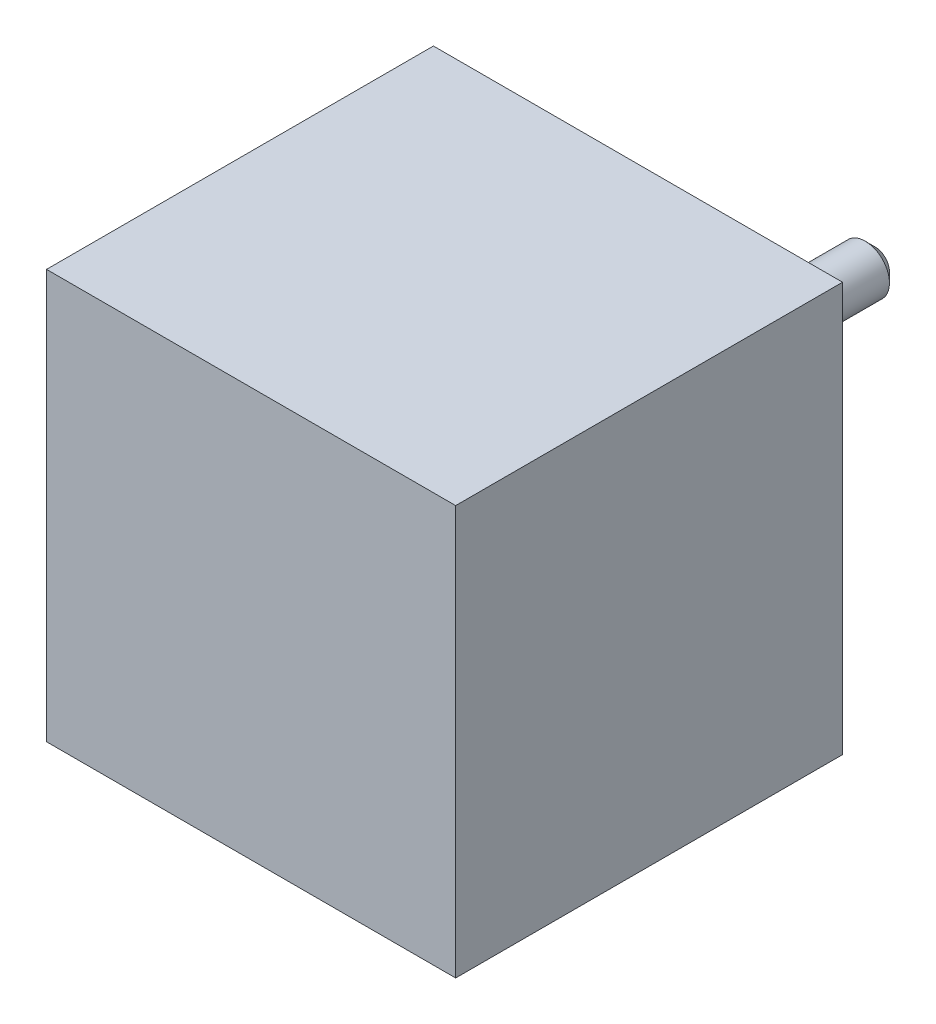
ISO-10303-21;
HEADER;
FILE_DESCRIPTION(('STEP AP214'),'2;1');
FILE_NAME('part.step','',(''),(''),'','','');
FILE_SCHEMA(('AUTOMOTIVE_DESIGN { 1 0 10303 214 1 1 1 1 }'));
ENDSEC;
DATA;
#1=APPLICATION_CONTEXT('core data for automotive mechanical design processes');
#2=APPLICATION_PROTOCOL_DEFINITION('international standard','automotive_design',2000,#1);
#3=PRODUCT_CONTEXT('',#1,'mechanical');
#4=PRODUCT('Part','Part','',(#3));
#5=PRODUCT_RELATED_PRODUCT_CATEGORY('part','',(#4));
#6=PRODUCT_DEFINITION_FORMATION('','',#4);
#7=PRODUCT_DEFINITION_CONTEXT('part definition',#1,'design');
#8=PRODUCT_DEFINITION('design','',#6,#7);
#9=PRODUCT_DEFINITION_SHAPE('','',#8);
#10=(LENGTH_UNIT() NAMED_UNIT(*) SI_UNIT(.MILLI.,.METRE.));
#11=(NAMED_UNIT(*) PLANE_ANGLE_UNIT() SI_UNIT($,.RADIAN.));
#12=(NAMED_UNIT(*) SI_UNIT($,.STERADIAN.) SOLID_ANGLE_UNIT());
#13=UNCERTAINTY_MEASURE_WITH_UNIT(LENGTH_MEASURE(1.E-05),#10,'distance_accuracy_value','');
#14=(GEOMETRIC_REPRESENTATION_CONTEXT(3) GLOBAL_UNCERTAINTY_ASSIGNED_CONTEXT((#13)) GLOBAL_UNIT_ASSIGNED_CONTEXT((#10,
#11,#12)) REPRESENTATION_CONTEXT('',''));
#15=CARTESIAN_POINT('',(0.,0.,0.));
#16=DIRECTION('',(0.,0.,1.));
#17=DIRECTION('',(1.,0.,0.));
#18=AXIS2_PLACEMENT_3D('',#15,#16,#17);
#19=CARTESIAN_POINT('',(21.15,21.15,-2.));
#20=DIRECTION('',(0.,0.,-1.));
#21=DIRECTION('',(-1.,0.,0.));
#22=AXIS2_PLACEMENT_3D('',#19,#20,#21);
#23=PLANE('',#22);
#24=CARTESIAN_POINT('',(21.15,21.15,-2.));
#25=DIRECTION('',(0.,0.,-1.));
#26=DIRECTION('',(-1.,0.,0.));
#27=AXIS2_PLACEMENT_3D('',#24,#25,#26);
#28=CIRCLE('',#27,11.);
#29=CARTESIAN_POINT('',(10.15,21.15,-2.));
#30=VERTEX_POINT('',#29);
#31=EDGE_CURVE('E106',#30,#30,#28,.T.);
#32=ORIENTED_EDGE('',*,*,#31,.T.);
#33=EDGE_LOOP('',(#32));
#34=FACE_BOUND('',#33,.T.);
#35=CARTESIAN_POINT('',(21.15,21.15,-2.));
#36=DIRECTION('',(0.,0.,-1.));
#37=DIRECTION('',(-1.,0.,0.));
#38=AXIS2_PLACEMENT_3D('',#35,#36,#37);
#39=CIRCLE('',#38,2.5);
#40=CARTESIAN_POINT('',(18.65,21.15,-2.));
#41=VERTEX_POINT('',#40);
#42=EDGE_CURVE('E167',#41,#41,#39,.T.);
#43=ORIENTED_EDGE('',*,*,#42,.F.);
#44=EDGE_LOOP('',(#43));
#45=FACE_BOUND('',#44,.T.);
#46=ADVANCED_FACE('F35',(#34,#45),#23,.T.);
#47=CARTESIAN_POINT('',(0.,0.,0.));
#48=DIRECTION('',(0.,0.,-1.));
#49=DIRECTION('',(-1.,0.,0.));
#50=AXIS2_PLACEMENT_3D('',#47,#48,#49);
#51=PLANE('',#50);
#52=CARTESIAN_POINT('',(36.65,36.65,0.));
#53=DIRECTION('',(0.,0.,-1.));
#54=DIRECTION('',(-1.,0.,0.));
#55=AXIS2_PLACEMENT_3D('',#52,#53,#54);
#56=CIRCLE('',#55,1.25);
#57=CARTESIAN_POINT('',(35.4,36.65,0.));
#58=VERTEX_POINT('',#57);
#59=EDGE_CURVE('E192',#58,#58,#56,.T.);
#60=ORIENTED_EDGE('',*,*,#59,.F.);
#61=EDGE_LOOP('',(#60));
#62=FACE_BOUND('',#61,.T.);
#63=CARTESIAN_POINT('',(36.65,5.65,0.));
#64=DIRECTION('',(0.,0.,-1.));
#65=DIRECTION('',(-1.,0.,0.));
#66=AXIS2_PLACEMENT_3D('',#63,#64,#65);
#67=CIRCLE('',#66,1.25);
#68=CARTESIAN_POINT('',(35.4,5.65,0.));
#69=VERTEX_POINT('',#68);
#70=EDGE_CURVE('E186',#69,#69,#67,.T.);
#71=ORIENTED_EDGE('',*,*,#70,.F.);
#72=EDGE_LOOP('',(#71));
#73=FACE_BOUND('',#72,.T.);
#74=CARTESIAN_POINT('',(5.65,5.65,0.));
#75=DIRECTION('',(0.,0.,-1.));
#76=DIRECTION('',(-1.,0.,0.));
#77=AXIS2_PLACEMENT_3D('',#74,#75,#76);
#78=CIRCLE('',#77,1.25);
#79=CARTESIAN_POINT('',(4.4,5.65,0.));
#80=VERTEX_POINT('',#79);
#81=EDGE_CURVE('E180',#80,#80,#78,.T.);
#82=ORIENTED_EDGE('',*,*,#81,.F.);
#83=EDGE_LOOP('',(#82));
#84=FACE_BOUND('',#83,.T.);
#85=CARTESIAN_POINT('',(5.65,36.65,0.));
#86=DIRECTION('',(0.,0.,-1.));
#87=DIRECTION('',(-1.,0.,0.));
#88=AXIS2_PLACEMENT_3D('',#85,#86,#87);
#89=CIRCLE('',#88,1.25);
#90=CARTESIAN_POINT('',(4.4,36.65,0.));
#91=VERTEX_POINT('',#90);
#92=EDGE_CURVE('E174',#91,#91,#89,.T.);
#93=ORIENTED_EDGE('',*,*,#92,.F.);
#94=EDGE_LOOP('',(#93));
#95=FACE_BOUND('',#94,.T.);
#96=DIRECTION('',(0.,-1.,0.));
#97=VECTOR('',#96,1.);
#98=CARTESIAN_POINT('',(0.,0.,0.));
#99=LINE('',#98,#97);
#100=CARTESIAN_POINT('',(0.,42.3,0.));
#101=VERTEX_POINT('',#100);
#102=CARTESIAN_POINT('',(0.,0.,0.));
#103=VERTEX_POINT('',#102);
#104=EDGE_CURVE('E103',#101,#103,#99,.T.);
#105=ORIENTED_EDGE('',*,*,#104,.F.);
#106=DIRECTION('',(-1.,0.,0.));
#107=VECTOR('',#106,1.);
#108=CARTESIAN_POINT('',(0.,42.3,0.));
#109=LINE('',#108,#107);
#110=CARTESIAN_POINT('',(42.3,42.3,0.));
#111=VERTEX_POINT('',#110);
#112=EDGE_CURVE('E75',#111,#101,#109,.T.);
#113=ORIENTED_EDGE('',*,*,#112,.F.);
#114=DIRECTION('',(0.,1.,0.));
#115=VECTOR('',#114,1.);
#116=CARTESIAN_POINT('',(42.3,0.,0.));
#117=LINE('',#116,#115);
#118=CARTESIAN_POINT('',(42.3,0.,0.));
#119=VERTEX_POINT('',#118);
#120=EDGE_CURVE('E69',#119,#111,#117,.T.);
#121=ORIENTED_EDGE('',*,*,#120,.F.);
#122=DIRECTION('',(1.,0.,0.));
#123=VECTOR('',#122,1.);
#124=CARTESIAN_POINT('',(0.,0.,0.));
#125=LINE('',#124,#123);
#126=EDGE_CURVE('E93',#103,#119,#125,.T.);
#127=ORIENTED_EDGE('',*,*,#126,.F.);
#128=EDGE_LOOP('',(#105,#113,#121,#127));
#129=FACE_BOUND('',#128,.T.);
#130=CARTESIAN_POINT('',(21.15,21.15,0.));
#131=DIRECTION('',(0.,0.,-1.));
#132=DIRECTION('',(-1.,0.,0.));
#133=AXIS2_PLACEMENT_3D('',#130,#131,#132);
#134=CIRCLE('',#133,11.);
#135=CARTESIAN_POINT('',(10.15,21.15,0.));
#136=VERTEX_POINT('',#135);
#137=EDGE_CURVE('E165',#136,#136,#134,.T.);
#138=ORIENTED_EDGE('',*,*,#137,.F.);
#139=EDGE_LOOP('',(#138));
#140=FACE_BOUND('',#139,.T.);
#141=ADVANCED_FACE('F131',(#62,#73,#84,#95,#129,#140),#51,.T.);
#142=CARTESIAN_POINT('',(0.,0.,40.));
#143=DIRECTION('',(1.,0.,0.));
#144=DIRECTION('',(0.,0.,-1.));
#145=AXIS2_PLACEMENT_3D('',#142,#143,#144);
#146=PLANE('',#145);
#147=ORIENTED_EDGE('',*,*,#104,.T.);
#148=DIRECTION('',(0.,0.,-1.));
#149=VECTOR('',#148,1.);
#150=CARTESIAN_POINT('',(0.,0.,40.));
#151=LINE('',#150,#149);
#152=CARTESIAN_POINT('',(0.,0.,40.));
#153=VERTEX_POINT('',#152);
#154=EDGE_CURVE('E94',#153,#103,#151,.T.);
#155=ORIENTED_EDGE('',*,*,#154,.F.);
#156=DIRECTION('',(0.,-1.,0.));
#157=VECTOR('',#156,1.);
#158=CARTESIAN_POINT('',(0.,0.,40.));
#159=LINE('',#158,#157);
#160=CARTESIAN_POINT('',(0.,42.3,40.));
#161=VERTEX_POINT('',#160);
#162=EDGE_CURVE('E88',#161,#153,#159,.T.);
#163=ORIENTED_EDGE('',*,*,#162,.F.);
#164=DIRECTION('',(0.,0.,-1.));
#165=VECTOR('',#164,1.);
#166=CARTESIAN_POINT('',(0.,42.3,40.));
#167=LINE('',#166,#165);
#168=EDGE_CURVE('E99',#161,#101,#167,.T.);
#169=ORIENTED_EDGE('',*,*,#168,.T.);
#170=EDGE_LOOP('',(#147,#155,#163,#169));
#171=FACE_BOUND('',#170,.T.);
#172=ADVANCED_FACE('F137',(#171),#146,.F.);
#173=CARTESIAN_POINT('',(0.,0.,40.));
#174=DIRECTION('',(0.,1.,0.));
#175=DIRECTION('',(0.,0.,1.));
#176=AXIS2_PLACEMENT_3D('',#173,#174,#175);
#177=PLANE('',#176);
#178=ORIENTED_EDGE('',*,*,#126,.T.);
#179=DIRECTION('',(0.,0.,-1.));
#180=VECTOR('',#179,1.);
#181=CARTESIAN_POINT('',(42.3,0.,40.));
#182=LINE('',#181,#180);
#183=CARTESIAN_POINT('',(42.3,0.,40.));
#184=VERTEX_POINT('',#183);
#185=EDGE_CURVE('E91',#184,#119,#182,.T.);
#186=ORIENTED_EDGE('',*,*,#185,.F.);
#187=DIRECTION('',(1.,0.,0.));
#188=VECTOR('',#187,1.);
#189=CARTESIAN_POINT('',(0.,0.,40.));
#190=LINE('',#189,#188);
#191=EDGE_CURVE('E83',#153,#184,#190,.T.);
#192=ORIENTED_EDGE('',*,*,#191,.F.);
#193=ORIENTED_EDGE('',*,*,#154,.T.);
#194=EDGE_LOOP('',(#178,#186,#192,#193));
#195=FACE_BOUND('',#194,.T.);
#196=ADVANCED_FACE('F92',(#195),#177,.F.);
#197=CARTESIAN_POINT('',(42.3,0.,40.));
#198=DIRECTION('',(-1.,0.,0.));
#199=DIRECTION('',(0.,0.,1.));
#200=AXIS2_PLACEMENT_3D('',#197,#198,#199);
#201=PLANE('',#200);
#202=ORIENTED_EDGE('',*,*,#120,.T.);
#203=DIRECTION('',(0.,0.,-1.));
#204=VECTOR('',#203,1.);
#205=CARTESIAN_POINT('',(42.3,42.3,40.));
#206=LINE('',#205,#204);
#207=CARTESIAN_POINT('',(42.3,42.3,40.));
#208=VERTEX_POINT('',#207);
#209=EDGE_CURVE('E95',#208,#111,#206,.T.);
#210=ORIENTED_EDGE('',*,*,#209,.F.);
#211=DIRECTION('',(0.,1.,0.));
#212=VECTOR('',#211,1.);
#213=CARTESIAN_POINT('',(42.3,0.,40.));
#214=LINE('',#213,#212);
#215=EDGE_CURVE('E86',#184,#208,#214,.T.);
#216=ORIENTED_EDGE('',*,*,#215,.F.);
#217=ORIENTED_EDGE('',*,*,#185,.T.);
#218=EDGE_LOOP('',(#202,#210,#216,#217));
#219=FACE_BOUND('',#218,.T.);
#220=ADVANCED_FACE('F97',(#219),#201,.F.);
#221=CARTESIAN_POINT('',(0.,42.3,40.));
#222=DIRECTION('',(0.,-1.,0.));
#223=DIRECTION('',(0.,0.,-1.));
#224=AXIS2_PLACEMENT_3D('',#221,#222,#223);
#225=PLANE('',#224);
#226=ORIENTED_EDGE('',*,*,#112,.T.);
#227=ORIENTED_EDGE('',*,*,#168,.F.);
#228=DIRECTION('',(-1.,0.,0.));
#229=VECTOR('',#228,1.);
#230=CARTESIAN_POINT('',(0.,42.3,40.));
#231=LINE('',#230,#229);
#232=EDGE_CURVE('E52',#208,#161,#231,.T.);
#233=ORIENTED_EDGE('',*,*,#232,.F.);
#234=ORIENTED_EDGE('',*,*,#209,.T.);
#235=EDGE_LOOP('',(#226,#227,#233,#234));
#236=FACE_BOUND('',#235,.T.);
#237=ADVANCED_FACE('F149',(#236),#225,.F.);
#238=CARTESIAN_POINT('',(0.,0.,40.));
#239=DIRECTION('',(0.,0.,-1.));
#240=DIRECTION('',(-1.,0.,0.));
#241=AXIS2_PLACEMENT_3D('',#238,#239,#240);
#242=PLANE('',#241);
#243=ORIENTED_EDGE('',*,*,#162,.T.);
#244=ORIENTED_EDGE('',*,*,#191,.T.);
#245=ORIENTED_EDGE('',*,*,#215,.T.);
#246=ORIENTED_EDGE('',*,*,#232,.T.);
#247=EDGE_LOOP('',(#243,#244,#245,#246));
#248=FACE_BOUND('',#247,.T.);
#249=ADVANCED_FACE('F84',(#248),#242,.F.);
#250=CARTESIAN_POINT('',(21.15,21.15,-2.));
#251=DIRECTION('',(0.,0.,1.));
#252=DIRECTION('',(1.,0.,0.));
#253=AXIS2_PLACEMENT_3D('',#250,#251,#252);
#254=CYLINDRICAL_SURFACE('',#253,11.);
#255=ORIENTED_EDGE('',*,*,#31,.F.);
#256=EDGE_LOOP('',(#255));
#257=FACE_BOUND('',#256,.T.);
#258=ORIENTED_EDGE('',*,*,#137,.T.);
#259=EDGE_LOOP('',(#258));
#260=FACE_BOUND('',#259,.T.);
#261=ADVANCED_FACE('F144',(#257,#260),#254,.T.);
#262=CARTESIAN_POINT('',(21.15,21.15,-24.5));
#263=DIRECTION('',(0.,0.,1.));
#264=DIRECTION('',(1.,0.,0.));
#265=AXIS2_PLACEMENT_3D('',#262,#263,#264);
#266=CYLINDRICAL_SURFACE('',#265,2.5);
#267=CARTESIAN_POINT('',(21.15,21.15,-23.5));
#268=DIRECTION('',(0.,0.,-1.));
#269=DIRECTION('',(-1.,0.,0.));
#270=AXIS2_PLACEMENT_3D('',#267,#268,#269);
#271=CIRCLE('',#270,2.5);
#272=CARTESIAN_POINT('',(18.65,21.15,-23.5));
#273=VERTEX_POINT('',#272);
#274=EDGE_CURVE('E11',#273,#273,#271,.F.);
#275=ORIENTED_EDGE('',*,*,#274,.T.);
#276=EDGE_LOOP('',(#275));
#277=FACE_BOUND('',#276,.T.);
#278=ORIENTED_EDGE('',*,*,#42,.T.);
#279=EDGE_LOOP('',(#278));
#280=FACE_BOUND('',#279,.T.);
#281=ADVANCED_FACE('F127',(#277,#280),#266,.T.);
#282=CARTESIAN_POINT('',(21.15,21.15,-24.5));
#283=DIRECTION('',(0.,0.,-1.));
#284=DIRECTION('',(-1.,0.,0.));
#285=AXIS2_PLACEMENT_3D('',#282,#283,#284);
#286=PLANE('',#285);
#287=CARTESIAN_POINT('',(21.15,21.15,-24.5));
#288=DIRECTION('',(0.,0.,-1.));
#289=DIRECTION('',(-1.,0.,0.));
#290=AXIS2_PLACEMENT_3D('',#287,#288,#289);
#291=CIRCLE('',#290,1.50000000000006);
#292=CARTESIAN_POINT('',(19.6499999999999,21.15,-24.5));
#293=VERTEX_POINT('',#292);
#294=EDGE_CURVE('E44',#293,#293,#291,.T.);
#295=ORIENTED_EDGE('',*,*,#294,.T.);
#296=EDGE_LOOP('',(#295));
#297=FACE_BOUND('',#296,.T.);
#298=ADVANCED_FACE('F115',(#297),#286,.T.);
#299=CARTESIAN_POINT('',(21.15,21.15,-24.5));
#300=DIRECTION('',(0.,0.,1.));
#301=DIRECTION('',(1.,0.,0.));
#302=AXIS2_PLACEMENT_3D('',#299,#300,#301);
#303=CONICAL_SURFACE('',#302,1.50000000000006,0.785398163397443);
#304=ORIENTED_EDGE('',*,*,#274,.F.);
#305=EDGE_LOOP('',(#304));
#306=FACE_BOUND('',#305,.T.);
#307=ORIENTED_EDGE('',*,*,#294,.F.);
#308=EDGE_LOOP('',(#307));
#309=FACE_BOUND('',#308,.T.);
#310=ADVANCED_FACE('F37',(#306,#309),#303,.T.);
#311=CARTESIAN_POINT('',(5.65,36.65,4.5));
#312=DIRECTION('',(0.,0.,-1.));
#313=DIRECTION('',(-1.,0.,0.));
#314=AXIS2_PLACEMENT_3D('',#311,#312,#313);
#315=CYLINDRICAL_SURFACE('',#314,1.25);
#316=CARTESIAN_POINT('',(5.65,36.65,4.5));
#317=DIRECTION('',(0.,0.,-1.));
#318=DIRECTION('',(-1.,0.,0.));
#319=AXIS2_PLACEMENT_3D('',#316,#317,#318);
#320=CIRCLE('',#319,1.25);
#321=CARTESIAN_POINT('',(4.4,36.65,4.5));
#322=VERTEX_POINT('',#321);
#323=EDGE_CURVE('E171',#322,#322,#320,.T.);
#324=ORIENTED_EDGE('',*,*,#323,.F.);
#325=EDGE_LOOP('',(#324));
#326=FACE_BOUND('',#325,.T.);
#327=ORIENTED_EDGE('',*,*,#92,.T.);
#328=EDGE_LOOP('',(#327));
#329=FACE_BOUND('',#328,.T.);
#330=ADVANCED_FACE('F118',(#326,#329),#315,.F.);
#331=CARTESIAN_POINT('',(5.65,36.65,4.5));
#332=DIRECTION('',(0.,0.,-1.));
#333=DIRECTION('',(-1.,0.,0.));
#334=AXIS2_PLACEMENT_3D('',#331,#332,#333);
#335=PLANE('',#334);
#336=ORIENTED_EDGE('',*,*,#323,.T.);
#337=EDGE_LOOP('',(#336));
#338=FACE_BOUND('',#337,.T.);
#339=ADVANCED_FACE('F124',(#338),#335,.T.);
#340=CARTESIAN_POINT('',(5.65,5.65,4.5));
#341=DIRECTION('',(0.,0.,-1.));
#342=DIRECTION('',(-1.,0.,0.));
#343=AXIS2_PLACEMENT_3D('',#340,#341,#342);
#344=CYLINDRICAL_SURFACE('',#343,1.25);
#345=CARTESIAN_POINT('',(5.65,5.65,4.5));
#346=DIRECTION('',(0.,0.,-1.));
#347=DIRECTION('',(-1.,0.,0.));
#348=AXIS2_PLACEMENT_3D('',#345,#346,#347);
#349=CIRCLE('',#348,1.25);
#350=CARTESIAN_POINT('',(4.4,5.65,4.5));
#351=VERTEX_POINT('',#350);
#352=EDGE_CURVE('E177',#351,#351,#349,.T.);
#353=ORIENTED_EDGE('',*,*,#352,.F.);
#354=EDGE_LOOP('',(#353));
#355=FACE_BOUND('',#354,.T.);
#356=ORIENTED_EDGE('',*,*,#81,.T.);
#357=EDGE_LOOP('',(#356));
#358=FACE_BOUND('',#357,.T.);
#359=ADVANCED_FACE('F214',(#355,#358),#344,.F.);
#360=CARTESIAN_POINT('',(5.65,5.65,4.5));
#361=DIRECTION('',(0.,0.,-1.));
#362=DIRECTION('',(-1.,0.,0.));
#363=AXIS2_PLACEMENT_3D('',#360,#361,#362);
#364=PLANE('',#363);
#365=ORIENTED_EDGE('',*,*,#352,.T.);
#366=EDGE_LOOP('',(#365));
#367=FACE_BOUND('',#366,.T.);
#368=ADVANCED_FACE('F216',(#367),#364,.T.);
#369=CARTESIAN_POINT('',(36.65,5.65,4.5));
#370=DIRECTION('',(0.,0.,-1.));
#371=DIRECTION('',(-1.,0.,0.));
#372=AXIS2_PLACEMENT_3D('',#369,#370,#371);
#373=CYLINDRICAL_SURFACE('',#372,1.25);
#374=CARTESIAN_POINT('',(36.65,5.65,4.5));
#375=DIRECTION('',(0.,0.,-1.));
#376=DIRECTION('',(-1.,0.,0.));
#377=AXIS2_PLACEMENT_3D('',#374,#375,#376);
#378=CIRCLE('',#377,1.25);
#379=CARTESIAN_POINT('',(35.4,5.65,4.5));
#380=VERTEX_POINT('',#379);
#381=EDGE_CURVE('E183',#380,#380,#378,.T.);
#382=ORIENTED_EDGE('',*,*,#381,.F.);
#383=EDGE_LOOP('',(#382));
#384=FACE_BOUND('',#383,.T.);
#385=ORIENTED_EDGE('',*,*,#70,.T.);
#386=EDGE_LOOP('',(#385));
#387=FACE_BOUND('',#386,.T.);
#388=ADVANCED_FACE('F223',(#384,#387),#373,.F.);
#389=CARTESIAN_POINT('',(36.65,5.65,4.5));
#390=DIRECTION('',(0.,0.,-1.));
#391=DIRECTION('',(-1.,0.,0.));
#392=AXIS2_PLACEMENT_3D('',#389,#390,#391);
#393=PLANE('',#392);
#394=ORIENTED_EDGE('',*,*,#381,.T.);
#395=EDGE_LOOP('',(#394));
#396=FACE_BOUND('',#395,.T.);
#397=ADVANCED_FACE('F203',(#396),#393,.T.);
#398=CARTESIAN_POINT('',(36.65,36.65,4.5));
#399=DIRECTION('',(0.,0.,-1.));
#400=DIRECTION('',(-1.,0.,0.));
#401=AXIS2_PLACEMENT_3D('',#398,#399,#400);
#402=CYLINDRICAL_SURFACE('',#401,1.25);
#403=CARTESIAN_POINT('',(36.65,36.65,4.5));
#404=DIRECTION('',(0.,0.,-1.));
#405=DIRECTION('',(-1.,0.,0.));
#406=AXIS2_PLACEMENT_3D('',#403,#404,#405);
#407=CIRCLE('',#406,1.25);
#408=CARTESIAN_POINT('',(35.4,36.65,4.5));
#409=VERTEX_POINT('',#408);
#410=EDGE_CURVE('E189',#409,#409,#407,.T.);
#411=ORIENTED_EDGE('',*,*,#410,.F.);
#412=EDGE_LOOP('',(#411));
#413=FACE_BOUND('',#412,.T.);
#414=ORIENTED_EDGE('',*,*,#59,.T.);
#415=EDGE_LOOP('',(#414));
#416=FACE_BOUND('',#415,.T.);
#417=ADVANCED_FACE('F200',(#413,#416),#402,.F.);
#418=CARTESIAN_POINT('',(36.65,36.65,4.5));
#419=DIRECTION('',(0.,0.,-1.));
#420=DIRECTION('',(-1.,0.,0.));
#421=AXIS2_PLACEMENT_3D('',#418,#419,#420);
#422=PLANE('',#421);
#423=ORIENTED_EDGE('',*,*,#410,.T.);
#424=EDGE_LOOP('',(#423));
#425=FACE_BOUND('',#424,.T.);
#426=ADVANCED_FACE('F198',(#425),#422,.T.);
#427=CLOSED_SHELL('',(#46,#141,#172,#196,#220,#237,#249,#261,#281,#298,#310,#330,#339,#359,#368,
#388,#397,#417,#426));
#428=MANIFOLD_SOLID_BREP('B2',#427);
#429=ADVANCED_BREP_SHAPE_REPRESENTATION('',(#18,#428),#14);
#430=SHAPE_DEFINITION_REPRESENTATION(#9,#429);
ENDSEC;
END-ISO-10303-21;
